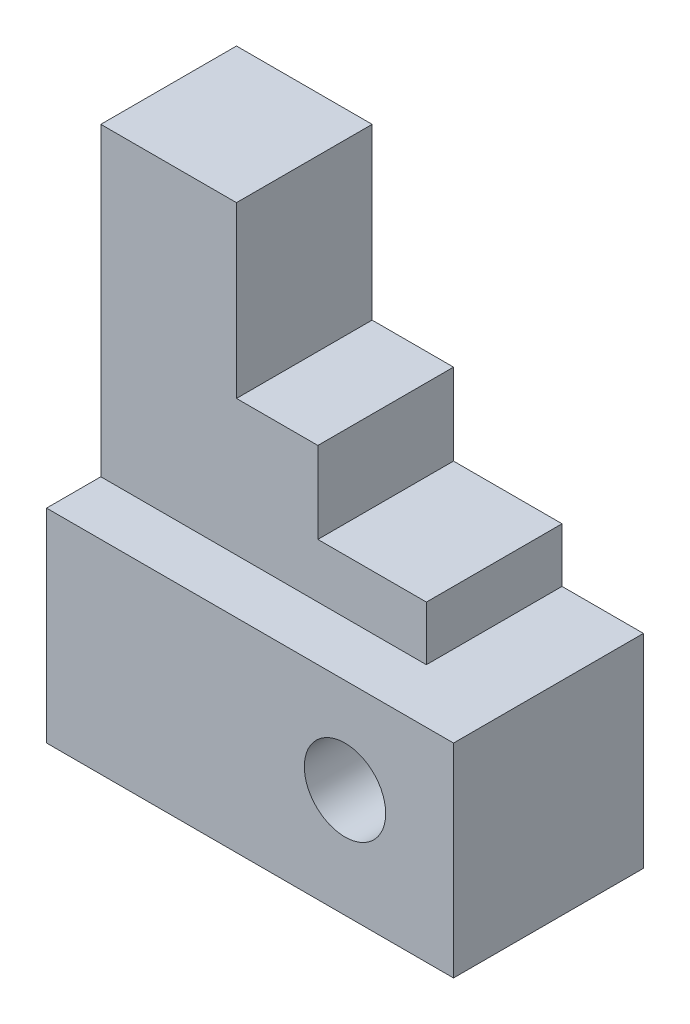
ISO-10303-21;
HEADER;
FILE_DESCRIPTION(('STEP AP214'),'2;1');
FILE_NAME('part.step','',(''),(''),'','','');
FILE_SCHEMA(('AUTOMOTIVE_DESIGN { 1 0 10303 214 1 1 1 1 }'));
ENDSEC;
DATA;
#1=APPLICATION_CONTEXT('core data for automotive mechanical design processes');
#2=APPLICATION_PROTOCOL_DEFINITION('international standard','automotive_design',2000,#1);
#3=PRODUCT_CONTEXT('',#1,'mechanical');
#4=PRODUCT('Part','Part','',(#3));
#5=PRODUCT_RELATED_PRODUCT_CATEGORY('part','',(#4));
#6=PRODUCT_DEFINITION_FORMATION('','',#4);
#7=PRODUCT_DEFINITION_CONTEXT('part definition',#1,'design');
#8=PRODUCT_DEFINITION('design','',#6,#7);
#9=PRODUCT_DEFINITION_SHAPE('','',#8);
#10=(LENGTH_UNIT() NAMED_UNIT(*) SI_UNIT(.MILLI.,.METRE.));
#11=(NAMED_UNIT(*) PLANE_ANGLE_UNIT() SI_UNIT($,.RADIAN.));
#12=(NAMED_UNIT(*) SI_UNIT($,.STERADIAN.) SOLID_ANGLE_UNIT());
#13=UNCERTAINTY_MEASURE_WITH_UNIT(LENGTH_MEASURE(1.E-05),#10,'distance_accuracy_value','');
#14=(GEOMETRIC_REPRESENTATION_CONTEXT(3) GLOBAL_UNCERTAINTY_ASSIGNED_CONTEXT((#13)) GLOBAL_UNIT_ASSIGNED_CONTEXT((#10,
#11,#12)) REPRESENTATION_CONTEXT('',''));
#15=CARTESIAN_POINT('',(0.,0.,0.));
#16=DIRECTION('',(0.,0.,1.));
#17=DIRECTION('',(1.,0.,0.));
#18=AXIS2_PLACEMENT_3D('',#15,#16,#17);
#19=CARTESIAN_POINT('',(0.,30.,0.));
#20=DIRECTION('',(0.,-1.,0.));
#21=DIRECTION('',(0.,0.,-1.));
#22=AXIS2_PLACEMENT_3D('',#19,#20,#21);
#23=PLANE('',#22);
#24=DIRECTION('',(0.,0.,-1.));
#25=VECTOR('',#24,1.);
#26=CARTESIAN_POINT('',(48.,30.,-8.));
#27=LINE('',#26,#25);
#28=CARTESIAN_POINT('',(48.,30.,-8.));
#29=VERTEX_POINT('',#28);
#30=CARTESIAN_POINT('',(48.,30.,-28.));
#31=VERTEX_POINT('',#30);
#32=EDGE_CURVE('E200',#29,#31,#27,.T.);
#33=ORIENTED_EDGE('',*,*,#32,.F.);
#34=DIRECTION('',(-1.,0.,0.));
#35=VECTOR('',#34,1.);
#36=CARTESIAN_POINT('',(48.,30.,-8.));
#37=LINE('',#36,#35);
#38=CARTESIAN_POINT('',(0.,30.,-8.));
#39=VERTEX_POINT('',#38);
#40=EDGE_CURVE('E154',#29,#39,#37,.T.);
#41=ORIENTED_EDGE('',*,*,#40,.T.);
#42=DIRECTION('',(0.,0.,1.));
#43=VECTOR('',#42,1.);
#44=CARTESIAN_POINT('',(0.,30.,0.));
#45=LINE('',#44,#43);
#46=CARTESIAN_POINT('',(0.,30.,0.));
#47=VERTEX_POINT('',#46);
#48=EDGE_CURVE('E89',#39,#47,#45,.T.);
#49=ORIENTED_EDGE('',*,*,#48,.T.);
#50=DIRECTION('',(1.,0.,0.));
#51=VECTOR('',#50,1.);
#52=CARTESIAN_POINT('',(0.,30.,0.));
#53=LINE('',#52,#51);
#54=CARTESIAN_POINT('',(60.,30.,0.));
#55=VERTEX_POINT('',#54);
#56=EDGE_CURVE('E220',#47,#55,#53,.T.);
#57=ORIENTED_EDGE('',*,*,#56,.T.);
#58=DIRECTION('',(0.,0.,-1.));
#59=VECTOR('',#58,1.);
#60=CARTESIAN_POINT('',(60.,30.,0.));
#61=LINE('',#60,#59);
#62=CARTESIAN_POINT('',(60.,30.,-28.));
#63=VERTEX_POINT('',#62);
#64=EDGE_CURVE('E64',#55,#63,#61,.T.);
#65=ORIENTED_EDGE('',*,*,#64,.T.);
#66=DIRECTION('',(-1.,0.,0.));
#67=VECTOR('',#66,1.);
#68=CARTESIAN_POINT('',(0.,30.,-28.));
#69=LINE('',#68,#67);
#70=EDGE_CURVE('E225',#63,#31,#69,.T.);
#71=ORIENTED_EDGE('',*,*,#70,.T.);
#72=EDGE_LOOP('',(#33,#41,#49,#57,#65,#71));
#73=FACE_BOUND('',#72,.T.);
#74=ADVANCED_FACE('F39',(#73),#23,.F.);
#75=CARTESIAN_POINT('',(0.,30.,0.));
#76=DIRECTION('',(1.,0.,0.));
#77=DIRECTION('',(0.,0.,-1.));
#78=AXIS2_PLACEMENT_3D('',#75,#76,#77);
#79=PLANE('',#78);
#80=DIRECTION('',(0.,0.,1.));
#81=VECTOR('',#80,1.);
#82=CARTESIAN_POINT('',(0.,0.,0.));
#83=LINE('',#82,#81);
#84=CARTESIAN_POINT('',(0.,0.,-28.));
#85=VERTEX_POINT('',#84);
#86=CARTESIAN_POINT('',(0.,0.,0.));
#87=VERTEX_POINT('',#86);
#88=EDGE_CURVE('E203',#85,#87,#83,.T.);
#89=ORIENTED_EDGE('',*,*,#88,.T.);
#90=DIRECTION('',(0.,-1.,0.));
#91=VECTOR('',#90,1.);
#92=CARTESIAN_POINT('',(0.,30.,0.));
#93=LINE('',#92,#91);
#94=EDGE_CURVE('E11',#47,#87,#93,.T.);
#95=ORIENTED_EDGE('',*,*,#94,.F.);
#96=ORIENTED_EDGE('',*,*,#48,.F.);
#97=DIRECTION('',(0.,1.,0.));
#98=VECTOR('',#97,1.);
#99=CARTESIAN_POINT('',(0.,30.,-8.));
#100=LINE('',#99,#98);
#101=CARTESIAN_POINT('',(0.,75.,-8.));
#102=VERTEX_POINT('',#101);
#103=EDGE_CURVE('E55',#39,#102,#100,.T.);
#104=ORIENTED_EDGE('',*,*,#103,.T.);
#105=DIRECTION('',(0.,0.,-1.));
#106=VECTOR('',#105,1.);
#107=CARTESIAN_POINT('',(0.,75.,-8.));
#108=LINE('',#107,#106);
#109=CARTESIAN_POINT('',(0.,75.,-28.));
#110=VERTEX_POINT('',#109);
#111=EDGE_CURVE('E134',#102,#110,#108,.T.);
#112=ORIENTED_EDGE('',*,*,#111,.T.);
#113=DIRECTION('',(0.,-1.,0.));
#114=VECTOR('',#113,1.);
#115=CARTESIAN_POINT('',(0.,30.,-28.));
#116=LINE('',#115,#114);
#117=EDGE_CURVE('E228',#110,#85,#116,.T.);
#118=ORIENTED_EDGE('',*,*,#117,.T.);
#119=EDGE_LOOP('',(#89,#95,#96,#104,#112,#118));
#120=FACE_BOUND('',#119,.T.);
#121=ADVANCED_FACE('F41',(#120),#79,.F.);
#122=CARTESIAN_POINT('',(0.,30.,0.));
#123=DIRECTION('',(0.,0.,-1.));
#124=DIRECTION('',(-1.,0.,0.));
#125=AXIS2_PLACEMENT_3D('',#122,#123,#124);
#126=PLANE('',#125);
#127=CARTESIAN_POINT('',(44.,16.,0.));
#128=DIRECTION('',(0.,0.,1.));
#129=DIRECTION('',(1.,0.,0.));
#130=AXIS2_PLACEMENT_3D('',#127,#128,#129);
#131=CIRCLE('',#130,5.99999999999999);
#132=CARTESIAN_POINT('',(50.,16.,0.));
#133=VERTEX_POINT('',#132);
#134=EDGE_CURVE('E303',#133,#133,#131,.T.);
#135=ORIENTED_EDGE('',*,*,#134,.F.);
#136=EDGE_LOOP('',(#135));
#137=FACE_BOUND('',#136,.T.);
#138=DIRECTION('',(1.,0.,0.));
#139=VECTOR('',#138,1.);
#140=CARTESIAN_POINT('',(0.,0.,0.));
#141=LINE('',#140,#139);
#142=CARTESIAN_POINT('',(60.,0.,0.));
#143=VERTEX_POINT('',#142);
#144=EDGE_CURVE('E231',#87,#143,#141,.T.);
#145=ORIENTED_EDGE('',*,*,#144,.T.);
#146=DIRECTION('',(0.,-1.,0.));
#147=VECTOR('',#146,1.);
#148=CARTESIAN_POINT('',(60.,30.,0.));
#149=LINE('',#148,#147);
#150=EDGE_CURVE('E48',#55,#143,#149,.T.);
#151=ORIENTED_EDGE('',*,*,#150,.F.);
#152=ORIENTED_EDGE('',*,*,#56,.F.);
#153=ORIENTED_EDGE('',*,*,#94,.T.);
#154=EDGE_LOOP('',(#145,#151,#152,#153));
#155=FACE_BOUND('',#154,.T.);
#156=ADVANCED_FACE('F287',(#137,#155),#126,.F.);
#157=CARTESIAN_POINT('',(60.,30.,0.));
#158=DIRECTION('',(-1.,0.,0.));
#159=DIRECTION('',(0.,0.,1.));
#160=AXIS2_PLACEMENT_3D('',#157,#158,#159);
#161=PLANE('',#160);
#162=DIRECTION('',(0.,0.,-1.));
#163=VECTOR('',#162,1.);
#164=CARTESIAN_POINT('',(60.,0.,0.));
#165=LINE('',#164,#163);
#166=CARTESIAN_POINT('',(60.,0.,-28.));
#167=VERTEX_POINT('',#166);
#168=EDGE_CURVE('E234',#143,#167,#165,.T.);
#169=ORIENTED_EDGE('',*,*,#168,.T.);
#170=DIRECTION('',(0.,-1.,0.));
#171=VECTOR('',#170,1.);
#172=CARTESIAN_POINT('',(60.,30.,-28.));
#173=LINE('',#172,#171);
#174=EDGE_CURVE('E241',#63,#167,#173,.T.);
#175=ORIENTED_EDGE('',*,*,#174,.F.);
#176=ORIENTED_EDGE('',*,*,#64,.F.);
#177=ORIENTED_EDGE('',*,*,#150,.T.);
#178=EDGE_LOOP('',(#169,#175,#176,#177));
#179=FACE_BOUND('',#178,.T.);
#180=ADVANCED_FACE('F248',(#179),#161,.F.);
#181=CARTESIAN_POINT('',(0.,30.,-28.));
#182=DIRECTION('',(0.,0.,1.));
#183=DIRECTION('',(1.,0.,0.));
#184=AXIS2_PLACEMENT_3D('',#181,#182,#183);
#185=PLANE('',#184);
#186=CARTESIAN_POINT('',(44.,16.,-28.));
#187=DIRECTION('',(0.,0.,1.));
#188=DIRECTION('',(1.,0.,0.));
#189=AXIS2_PLACEMENT_3D('',#186,#187,#188);
#190=CIRCLE('',#189,5.99999999999999);
#191=CARTESIAN_POINT('',(50.,16.,-28.));
#192=VERTEX_POINT('',#191);
#193=EDGE_CURVE('E181',#192,#192,#190,.T.);
#194=ORIENTED_EDGE('',*,*,#193,.T.);
#195=EDGE_LOOP('',(#194));
#196=FACE_BOUND('',#195,.T.);
#197=DIRECTION('',(-1.,0.,0.));
#198=VECTOR('',#197,1.);
#199=CARTESIAN_POINT('',(0.,0.,-28.));
#200=LINE('',#199,#198);
#201=EDGE_CURVE('E85',#167,#85,#200,.T.);
#202=ORIENTED_EDGE('',*,*,#201,.T.);
#203=ORIENTED_EDGE('',*,*,#117,.F.);
#204=DIRECTION('',(1.,0.,0.));
#205=VECTOR('',#204,1.);
#206=CARTESIAN_POINT('',(0.,75.,-28.));
#207=LINE('',#206,#205);
#208=CARTESIAN_POINT('',(20.,75.,-28.));
#209=VERTEX_POINT('',#208);
#210=EDGE_CURVE('E138',#110,#209,#207,.T.);
#211=ORIENTED_EDGE('',*,*,#210,.T.);
#212=DIRECTION('',(0.,-1.,0.));
#213=VECTOR('',#212,1.);
#214=CARTESIAN_POINT('',(20.,75.,-28.));
#215=LINE('',#214,#213);
#216=CARTESIAN_POINT('',(20.,50.,-28.));
#217=VERTEX_POINT('',#216);
#218=EDGE_CURVE('E180',#209,#217,#215,.T.);
#219=ORIENTED_EDGE('',*,*,#218,.T.);
#220=DIRECTION('',(1.,0.,0.));
#221=VECTOR('',#220,1.);
#222=CARTESIAN_POINT('',(20.,50.,-28.));
#223=LINE('',#222,#221);
#224=CARTESIAN_POINT('',(32.,50.,-28.));
#225=VERTEX_POINT('',#224);
#226=EDGE_CURVE('E185',#217,#225,#223,.T.);
#227=ORIENTED_EDGE('',*,*,#226,.T.);
#228=DIRECTION('',(0.,-1.,0.));
#229=VECTOR('',#228,1.);
#230=CARTESIAN_POINT('',(32.,50.,-28.));
#231=LINE('',#230,#229);
#232=CARTESIAN_POINT('',(32.,38.,-28.));
#233=VERTEX_POINT('',#232);
#234=EDGE_CURVE('E189',#225,#233,#231,.T.);
#235=ORIENTED_EDGE('',*,*,#234,.T.);
#236=DIRECTION('',(1.,0.,0.));
#237=VECTOR('',#236,1.);
#238=CARTESIAN_POINT('',(32.,38.,-28.));
#239=LINE('',#238,#237);
#240=CARTESIAN_POINT('',(48.,38.,-28.));
#241=VERTEX_POINT('',#240);
#242=EDGE_CURVE('E193',#233,#241,#239,.T.);
#243=ORIENTED_EDGE('',*,*,#242,.T.);
#244=DIRECTION('',(0.,-1.,0.));
#245=VECTOR('',#244,1.);
#246=CARTESIAN_POINT('',(48.,38.,-28.));
#247=LINE('',#246,#245);
#248=EDGE_CURVE('E157',#241,#31,#247,.T.);
#249=ORIENTED_EDGE('',*,*,#248,.T.);
#250=ORIENTED_EDGE('',*,*,#70,.F.);
#251=ORIENTED_EDGE('',*,*,#174,.T.);
#252=EDGE_LOOP('',(#202,#203,#211,#219,#227,#235,#243,#249,#250,#251));
#253=FACE_BOUND('',#252,.T.);
#254=ADVANCED_FACE('F253',(#196,#253),#185,.F.);
#255=CARTESIAN_POINT('',(0.,0.,0.));
#256=DIRECTION('',(0.,-1.,0.));
#257=DIRECTION('',(0.,0.,-1.));
#258=AXIS2_PLACEMENT_3D('',#255,#256,#257);
#259=PLANE('',#258);
#260=ORIENTED_EDGE('',*,*,#88,.F.);
#261=ORIENTED_EDGE('',*,*,#201,.F.);
#262=ORIENTED_EDGE('',*,*,#168,.F.);
#263=ORIENTED_EDGE('',*,*,#144,.F.);
#264=EDGE_LOOP('',(#260,#261,#262,#263));
#265=FACE_BOUND('',#264,.T.);
#266=ADVANCED_FACE('F252',(#265),#259,.T.);
#267=CARTESIAN_POINT('',(48.,38.,-8.));
#268=DIRECTION('',(1.,0.,0.));
#269=DIRECTION('',(0.,1.,0.));
#270=AXIS2_PLACEMENT_3D('',#267,#268,#269);
#271=PLANE('',#270);
#272=ORIENTED_EDGE('',*,*,#248,.F.);
#273=DIRECTION('',(0.,0.,-1.));
#274=VECTOR('',#273,1.);
#275=CARTESIAN_POINT('',(48.,38.,-8.));
#276=LINE('',#275,#274);
#277=CARTESIAN_POINT('',(48.,38.,-8.));
#278=VERTEX_POINT('',#277);
#279=EDGE_CURVE('E204',#278,#241,#276,.T.);
#280=ORIENTED_EDGE('',*,*,#279,.F.);
#281=DIRECTION('',(0.,-1.,0.));
#282=VECTOR('',#281,1.);
#283=CARTESIAN_POINT('',(48.,38.,-8.));
#284=LINE('',#283,#282);
#285=EDGE_CURVE('E142',#278,#29,#284,.T.);
#286=ORIENTED_EDGE('',*,*,#285,.T.);
#287=ORIENTED_EDGE('',*,*,#32,.T.);
#288=EDGE_LOOP('',(#272,#280,#286,#287));
#289=FACE_BOUND('',#288,.T.);
#290=ADVANCED_FACE('F269',(#289),#271,.T.);
#291=CARTESIAN_POINT('',(32.,38.,-8.));
#292=DIRECTION('',(0.,1.,0.));
#293=DIRECTION('',(0.,0.,1.));
#294=AXIS2_PLACEMENT_3D('',#291,#292,#293);
#295=PLANE('',#294);
#296=ORIENTED_EDGE('',*,*,#242,.F.);
#297=DIRECTION('',(0.,0.,-1.));
#298=VECTOR('',#297,1.);
#299=CARTESIAN_POINT('',(32.,38.,-8.));
#300=LINE('',#299,#298);
#301=CARTESIAN_POINT('',(32.,38.,-8.));
#302=VERTEX_POINT('',#301);
#303=EDGE_CURVE('E207',#302,#233,#300,.T.);
#304=ORIENTED_EDGE('',*,*,#303,.F.);
#305=DIRECTION('',(1.,0.,0.));
#306=VECTOR('',#305,1.);
#307=CARTESIAN_POINT('',(32.,38.,-8.));
#308=LINE('',#307,#306);
#309=EDGE_CURVE('E171',#302,#278,#308,.T.);
#310=ORIENTED_EDGE('',*,*,#309,.T.);
#311=ORIENTED_EDGE('',*,*,#279,.T.);
#312=EDGE_LOOP('',(#296,#304,#310,#311));
#313=FACE_BOUND('',#312,.T.);
#314=ADVANCED_FACE('F273',(#313),#295,.T.);
#315=CARTESIAN_POINT('',(32.,50.,-8.));
#316=DIRECTION('',(1.,0.,0.));
#317=DIRECTION('',(0.,1.,0.));
#318=AXIS2_PLACEMENT_3D('',#315,#316,#317);
#319=PLANE('',#318);
#320=ORIENTED_EDGE('',*,*,#234,.F.);
#321=DIRECTION('',(0.,0.,-1.));
#322=VECTOR('',#321,1.);
#323=CARTESIAN_POINT('',(32.,50.,-8.));
#324=LINE('',#323,#322);
#325=CARTESIAN_POINT('',(32.,50.,-8.));
#326=VERTEX_POINT('',#325);
#327=EDGE_CURVE('E210',#326,#225,#324,.T.);
#328=ORIENTED_EDGE('',*,*,#327,.F.);
#329=DIRECTION('',(0.,-1.,0.));
#330=VECTOR('',#329,1.);
#331=CARTESIAN_POINT('',(32.,50.,-8.));
#332=LINE('',#331,#330);
#333=EDGE_CURVE('E167',#326,#302,#332,.T.);
#334=ORIENTED_EDGE('',*,*,#333,.T.);
#335=ORIENTED_EDGE('',*,*,#303,.T.);
#336=EDGE_LOOP('',(#320,#328,#334,#335));
#337=FACE_BOUND('',#336,.T.);
#338=ADVANCED_FACE('F263',(#337),#319,.T.);
#339=CARTESIAN_POINT('',(20.,50.,-8.));
#340=DIRECTION('',(0.,1.,0.));
#341=DIRECTION('',(-1.,0.,0.));
#342=AXIS2_PLACEMENT_3D('',#339,#340,#341);
#343=PLANE('',#342);
#344=ORIENTED_EDGE('',*,*,#226,.F.);
#345=DIRECTION('',(0.,0.,-1.));
#346=VECTOR('',#345,1.);
#347=CARTESIAN_POINT('',(20.,50.,-8.));
#348=LINE('',#347,#346);
#349=CARTESIAN_POINT('',(20.,50.,-8.));
#350=VERTEX_POINT('',#349);
#351=EDGE_CURVE('E213',#350,#217,#348,.T.);
#352=ORIENTED_EDGE('',*,*,#351,.F.);
#353=DIRECTION('',(1.,0.,0.));
#354=VECTOR('',#353,1.);
#355=CARTESIAN_POINT('',(20.,50.,-8.));
#356=LINE('',#355,#354);
#357=EDGE_CURVE('E163',#350,#326,#356,.T.);
#358=ORIENTED_EDGE('',*,*,#357,.T.);
#359=ORIENTED_EDGE('',*,*,#327,.T.);
#360=EDGE_LOOP('',(#344,#352,#358,#359));
#361=FACE_BOUND('',#360,.T.);
#362=ADVANCED_FACE('F259',(#361),#343,.T.);
#363=CARTESIAN_POINT('',(20.,75.,-8.));
#364=DIRECTION('',(1.,0.,0.));
#365=DIRECTION('',(0.,1.,0.));
#366=AXIS2_PLACEMENT_3D('',#363,#364,#365);
#367=PLANE('',#366);
#368=ORIENTED_EDGE('',*,*,#218,.F.);
#369=DIRECTION('',(0.,0.,-1.));
#370=VECTOR('',#369,1.);
#371=CARTESIAN_POINT('',(20.,75.,-8.));
#372=LINE('',#371,#370);
#373=CARTESIAN_POINT('',(20.,75.,-8.));
#374=VERTEX_POINT('',#373);
#375=EDGE_CURVE('E141',#374,#209,#372,.T.);
#376=ORIENTED_EDGE('',*,*,#375,.F.);
#377=DIRECTION('',(0.,-1.,0.));
#378=VECTOR('',#377,1.);
#379=CARTESIAN_POINT('',(20.,75.,-8.));
#380=LINE('',#379,#378);
#381=EDGE_CURVE('E148',#374,#350,#380,.T.);
#382=ORIENTED_EDGE('',*,*,#381,.T.);
#383=ORIENTED_EDGE('',*,*,#351,.T.);
#384=EDGE_LOOP('',(#368,#376,#382,#383));
#385=FACE_BOUND('',#384,.T.);
#386=ADVANCED_FACE('F257',(#385),#367,.T.);
#387=CARTESIAN_POINT('',(0.,75.,-8.));
#388=DIRECTION('',(0.,1.,0.));
#389=DIRECTION('',(0.,0.,1.));
#390=AXIS2_PLACEMENT_3D('',#387,#388,#389);
#391=PLANE('',#390);
#392=ORIENTED_EDGE('',*,*,#210,.F.);
#393=ORIENTED_EDGE('',*,*,#111,.F.);
#394=DIRECTION('',(1.,0.,0.));
#395=VECTOR('',#394,1.);
#396=CARTESIAN_POINT('',(0.,75.,-8.));
#397=LINE('',#396,#395);
#398=EDGE_CURVE('E136',#102,#374,#397,.T.);
#399=ORIENTED_EDGE('',*,*,#398,.T.);
#400=ORIENTED_EDGE('',*,*,#375,.T.);
#401=EDGE_LOOP('',(#392,#393,#399,#400));
#402=FACE_BOUND('',#401,.T.);
#403=ADVANCED_FACE('F135',(#402),#391,.T.);
#404=CARTESIAN_POINT('',(0.,0.,-8.));
#405=DIRECTION('',(0.,0.,-1.));
#406=DIRECTION('',(-1.,0.,0.));
#407=AXIS2_PLACEMENT_3D('',#404,#405,#406);
#408=PLANE('',#407);
#409=ORIENTED_EDGE('',*,*,#40,.F.);
#410=ORIENTED_EDGE('',*,*,#285,.F.);
#411=ORIENTED_EDGE('',*,*,#309,.F.);
#412=ORIENTED_EDGE('',*,*,#333,.F.);
#413=ORIENTED_EDGE('',*,*,#357,.F.);
#414=ORIENTED_EDGE('',*,*,#381,.F.);
#415=ORIENTED_EDGE('',*,*,#398,.F.);
#416=ORIENTED_EDGE('',*,*,#103,.F.);
#417=EDGE_LOOP('',(#409,#410,#411,#412,#413,#414,#415,#416));
#418=FACE_BOUND('',#417,.T.);
#419=ADVANCED_FACE('F145',(#418),#408,.F.);
#420=CARTESIAN_POINT('',(44.,16.,-28.));
#421=DIRECTION('',(0.,0.,1.));
#422=DIRECTION('',(1.,0.,0.));
#423=AXIS2_PLACEMENT_3D('',#420,#421,#422);
#424=CYLINDRICAL_SURFACE('',#423,5.99999999999999);
#425=ORIENTED_EDGE('',*,*,#193,.F.);
#426=EDGE_LOOP('',(#425));
#427=FACE_BOUND('',#426,.T.);
#428=ORIENTED_EDGE('',*,*,#134,.T.);
#429=EDGE_LOOP('',(#428));
#430=FACE_BOUND('',#429,.T.);
#431=ADVANCED_FACE('F311',(#427,#430),#424,.F.);
#432=CLOSED_SHELL('',(#74,#121,#156,#180,#254,#266,#290,#314,#338,#362,#386,#403,#419,#431));
#433=MANIFOLD_SOLID_BREP('B2',#432);
#434=ADVANCED_BREP_SHAPE_REPRESENTATION('',(#18,#433),#14);
#435=SHAPE_DEFINITION_REPRESENTATION(#9,#434);
ENDSEC;
END-ISO-10303-21;
